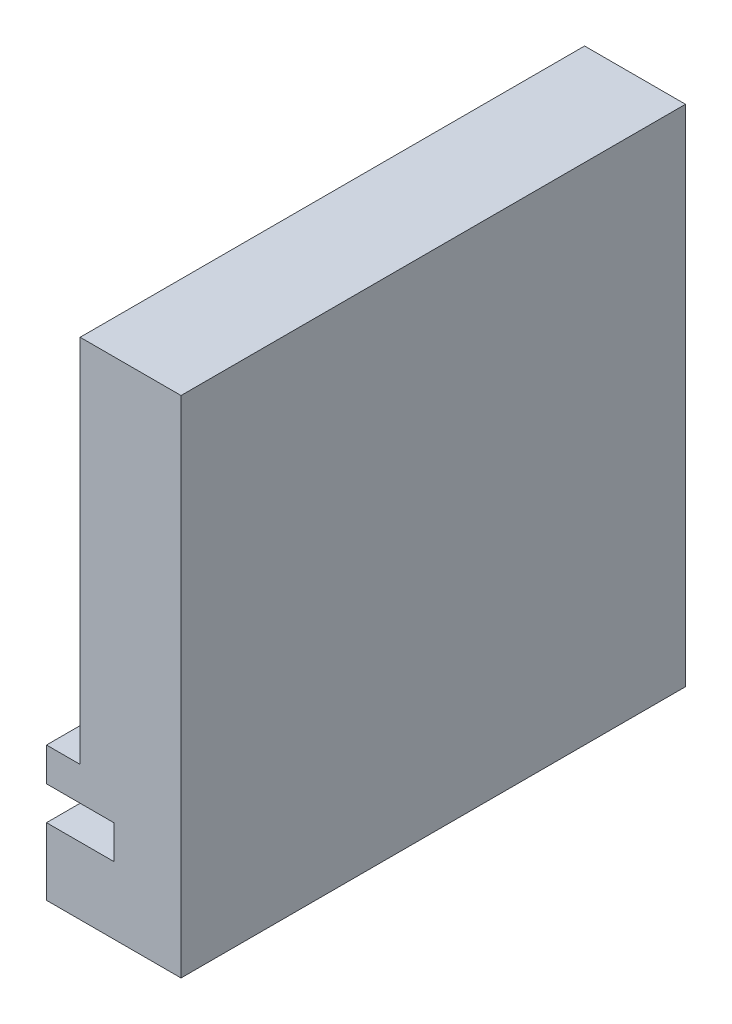
ISO-10303-21;
HEADER;
FILE_DESCRIPTION(('STEP AP214'),'2;1');
FILE_NAME('part.step','',(''),(''),'','','');
FILE_SCHEMA(('AUTOMOTIVE_DESIGN { 1 0 10303 214 1 1 1 1 }'));
ENDSEC;
DATA;
#1=APPLICATION_CONTEXT('core data for automotive mechanical design processes');
#2=APPLICATION_PROTOCOL_DEFINITION('international standard','automotive_design',2000,#1);
#3=PRODUCT_CONTEXT('',#1,'mechanical');
#4=PRODUCT('Part','Part','',(#3));
#5=PRODUCT_RELATED_PRODUCT_CATEGORY('part','',(#4));
#6=PRODUCT_DEFINITION_FORMATION('','',#4);
#7=PRODUCT_DEFINITION_CONTEXT('part definition',#1,'design');
#8=PRODUCT_DEFINITION('design','',#6,#7);
#9=PRODUCT_DEFINITION_SHAPE('','',#8);
#10=(LENGTH_UNIT() NAMED_UNIT(*) SI_UNIT(.MILLI.,.METRE.));
#11=(NAMED_UNIT(*) PLANE_ANGLE_UNIT() SI_UNIT($,.RADIAN.));
#12=(NAMED_UNIT(*) SI_UNIT($,.STERADIAN.) SOLID_ANGLE_UNIT());
#13=UNCERTAINTY_MEASURE_WITH_UNIT(LENGTH_MEASURE(1.E-05),#10,'distance_accuracy_value','');
#14=(GEOMETRIC_REPRESENTATION_CONTEXT(3) GLOBAL_UNCERTAINTY_ASSIGNED_CONTEXT((#13)) GLOBAL_UNIT_ASSIGNED_CONTEXT((#10,
#11,#12)) REPRESENTATION_CONTEXT('',''));
#15=CARTESIAN_POINT('',(0.,0.,0.));
#16=DIRECTION('',(0.,0.,1.));
#17=DIRECTION('',(1.,0.,0.));
#18=AXIS2_PLACEMENT_3D('',#15,#16,#17);
#19=CARTESIAN_POINT('',(20.,30.,150.));
#20=DIRECTION('',(1.,0.,0.));
#21=DIRECTION('',(0.,0.,-1.));
#22=AXIS2_PLACEMENT_3D('',#19,#20,#21);
#23=PLANE('',#22);
#24=DIRECTION('',(0.,-1.,0.));
#25=VECTOR('',#24,1.);
#26=CARTESIAN_POINT('',(20.,30.,0.));
#27=LINE('',#26,#25);
#28=CARTESIAN_POINT('',(20.,30.,0.));
#29=VERTEX_POINT('',#28);
#30=CARTESIAN_POINT('',(20.,20.,0.));
#31=VERTEX_POINT('',#30);
#32=EDGE_CURVE('E158',#29,#31,#27,.T.);
#33=ORIENTED_EDGE('',*,*,#32,.T.);
#34=DIRECTION('',(0.,0.,-1.));
#35=VECTOR('',#34,1.);
#36=CARTESIAN_POINT('',(20.,20.,150.));
#37=LINE('',#36,#35);
#38=CARTESIAN_POINT('',(20.,20.,150.));
#39=VERTEX_POINT('',#38);
#40=EDGE_CURVE('E11',#39,#31,#37,.T.);
#41=ORIENTED_EDGE('',*,*,#40,.F.);
#42=DIRECTION('',(0.,-1.,0.));
#43=VECTOR('',#42,1.);
#44=CARTESIAN_POINT('',(20.,30.,150.));
#45=LINE('',#44,#43);
#46=CARTESIAN_POINT('',(20.,30.,150.));
#47=VERTEX_POINT('',#46);
#48=EDGE_CURVE('E186',#47,#39,#45,.T.);
#49=ORIENTED_EDGE('',*,*,#48,.F.);
#50=DIRECTION('',(0.,0.,-1.));
#51=VECTOR('',#50,1.);
#52=CARTESIAN_POINT('',(20.,30.,150.));
#53=LINE('',#52,#51);
#54=EDGE_CURVE('E154',#47,#29,#53,.T.);
#55=ORIENTED_EDGE('',*,*,#54,.T.);
#56=EDGE_LOOP('',(#33,#41,#49,#55));
#57=FACE_BOUND('',#56,.T.);
#58=ADVANCED_FACE('F45',(#57),#23,.F.);
#59=CARTESIAN_POINT('',(20.,20.,150.));
#60=DIRECTION('',(0.,-1.,0.));
#61=DIRECTION('',(1.,0.,0.));
#62=AXIS2_PLACEMENT_3D('',#59,#60,#61);
#63=PLANE('',#62);
#64=DIRECTION('',(-1.,0.,0.));
#65=VECTOR('',#64,1.);
#66=CARTESIAN_POINT('',(20.,20.,0.));
#67=LINE('',#66,#65);
#68=CARTESIAN_POINT('',(0.,20.,0.));
#69=VERTEX_POINT('',#68);
#70=EDGE_CURVE('E162',#31,#69,#67,.T.);
#71=ORIENTED_EDGE('',*,*,#70,.T.);
#72=DIRECTION('',(0.,0.,-1.));
#73=VECTOR('',#72,1.);
#74=CARTESIAN_POINT('',(0.,20.,150.));
#75=LINE('',#74,#73);
#76=CARTESIAN_POINT('',(0.,20.,150.));
#77=VERTEX_POINT('',#76);
#78=EDGE_CURVE('E54',#77,#69,#75,.T.);
#79=ORIENTED_EDGE('',*,*,#78,.F.);
#80=DIRECTION('',(-1.,0.,0.));
#81=VECTOR('',#80,1.);
#82=CARTESIAN_POINT('',(20.,20.,150.));
#83=LINE('',#82,#81);
#84=EDGE_CURVE('E111',#39,#77,#83,.T.);
#85=ORIENTED_EDGE('',*,*,#84,.F.);
#86=ORIENTED_EDGE('',*,*,#40,.T.);
#87=EDGE_LOOP('',(#71,#79,#85,#86));
#88=FACE_BOUND('',#87,.T.);
#89=ADVANCED_FACE('F250',(#88),#63,.F.);
#90=CARTESIAN_POINT('',(0.,20.,150.));
#91=DIRECTION('',(1.,0.,0.));
#92=DIRECTION('',(0.,0.,-1.));
#93=AXIS2_PLACEMENT_3D('',#90,#91,#92);
#94=PLANE('',#93);
#95=DIRECTION('',(0.,-1.,0.));
#96=VECTOR('',#95,1.);
#97=CARTESIAN_POINT('',(0.,20.,0.));
#98=LINE('',#97,#96);
#99=CARTESIAN_POINT('',(0.,0.,0.));
#100=VERTEX_POINT('',#99);
#101=EDGE_CURVE('E165',#69,#100,#98,.T.);
#102=ORIENTED_EDGE('',*,*,#101,.T.);
#103=DIRECTION('',(0.,0.,-1.));
#104=VECTOR('',#103,1.);
#105=CARTESIAN_POINT('',(0.,0.,150.));
#106=LINE('',#105,#104);
#107=CARTESIAN_POINT('',(0.,0.,150.));
#108=VERTEX_POINT('',#107);
#109=EDGE_CURVE('E205',#108,#100,#106,.T.);
#110=ORIENTED_EDGE('',*,*,#109,.F.);
#111=DIRECTION('',(0.,-1.,0.));
#112=VECTOR('',#111,1.);
#113=CARTESIAN_POINT('',(0.,20.,150.));
#114=LINE('',#113,#112);
#115=EDGE_CURVE('E215',#77,#108,#114,.T.);
#116=ORIENTED_EDGE('',*,*,#115,.F.);
#117=ORIENTED_EDGE('',*,*,#78,.T.);
#118=EDGE_LOOP('',(#102,#110,#116,#117));
#119=FACE_BOUND('',#118,.T.);
#120=ADVANCED_FACE('F213',(#119),#94,.F.);
#121=CARTESIAN_POINT('',(0.,0.,150.));
#122=DIRECTION('',(0.,1.,0.));
#123=DIRECTION('',(0.,0.,1.));
#124=AXIS2_PLACEMENT_3D('',#121,#122,#123);
#125=PLANE('',#124);
#126=DIRECTION('',(1.,0.,0.));
#127=VECTOR('',#126,1.);
#128=CARTESIAN_POINT('',(0.,0.,0.));
#129=LINE('',#128,#127);
#130=CARTESIAN_POINT('',(40.,0.,0.));
#131=VERTEX_POINT('',#130);
#132=EDGE_CURVE('E168',#100,#131,#129,.T.);
#133=ORIENTED_EDGE('',*,*,#132,.T.);
#134=DIRECTION('',(0.,0.,-1.));
#135=VECTOR('',#134,1.);
#136=CARTESIAN_POINT('',(40.,0.,150.));
#137=LINE('',#136,#135);
#138=CARTESIAN_POINT('',(40.,0.,150.));
#139=VERTEX_POINT('',#138);
#140=EDGE_CURVE('E201',#139,#131,#137,.T.);
#141=ORIENTED_EDGE('',*,*,#140,.F.);
#142=DIRECTION('',(1.,0.,0.));
#143=VECTOR('',#142,1.);
#144=CARTESIAN_POINT('',(0.,0.,150.));
#145=LINE('',#144,#143);
#146=EDGE_CURVE('E234',#108,#139,#145,.T.);
#147=ORIENTED_EDGE('',*,*,#146,.F.);
#148=ORIENTED_EDGE('',*,*,#109,.T.);
#149=EDGE_LOOP('',(#133,#141,#147,#148));
#150=FACE_BOUND('',#149,.T.);
#151=ADVANCED_FACE('F224',(#150),#125,.F.);
#152=CARTESIAN_POINT('',(40.,0.,150.));
#153=DIRECTION('',(-1.,0.,0.));
#154=DIRECTION('',(0.,0.,1.));
#155=AXIS2_PLACEMENT_3D('',#152,#153,#154);
#156=PLANE('',#155);
#157=DIRECTION('',(0.,1.,0.));
#158=VECTOR('',#157,1.);
#159=CARTESIAN_POINT('',(40.,0.,0.));
#160=LINE('',#159,#158);
#161=CARTESIAN_POINT('',(40.,150.,0.));
#162=VERTEX_POINT('',#161);
#163=EDGE_CURVE('E171',#131,#162,#160,.T.);
#164=ORIENTED_EDGE('',*,*,#163,.T.);
#165=DIRECTION('',(0.,0.,-1.));
#166=VECTOR('',#165,1.);
#167=CARTESIAN_POINT('',(40.,150.,150.));
#168=LINE('',#167,#166);
#169=CARTESIAN_POINT('',(40.,150.,150.));
#170=VERTEX_POINT('',#169);
#171=EDGE_CURVE('E197',#170,#162,#168,.T.);
#172=ORIENTED_EDGE('',*,*,#171,.F.);
#173=DIRECTION('',(0.,1.,0.));
#174=VECTOR('',#173,1.);
#175=CARTESIAN_POINT('',(40.,0.,150.));
#176=LINE('',#175,#174);
#177=EDGE_CURVE('E230',#139,#170,#176,.T.);
#178=ORIENTED_EDGE('',*,*,#177,.F.);
#179=ORIENTED_EDGE('',*,*,#140,.T.);
#180=EDGE_LOOP('',(#164,#172,#178,#179));
#181=FACE_BOUND('',#180,.T.);
#182=ADVANCED_FACE('F228',(#181),#156,.F.);
#183=CARTESIAN_POINT('',(40.,150.,150.));
#184=DIRECTION('',(0.,-1.,0.));
#185=DIRECTION('',(0.,0.,-1.));
#186=AXIS2_PLACEMENT_3D('',#183,#184,#185);
#187=PLANE('',#186);
#188=DIRECTION('',(-1.,0.,0.));
#189=VECTOR('',#188,1.);
#190=CARTESIAN_POINT('',(40.,150.,0.));
#191=LINE('',#190,#189);
#192=CARTESIAN_POINT('',(10.,150.,0.));
#193=VERTEX_POINT('',#192);
#194=EDGE_CURVE('E174',#162,#193,#191,.T.);
#195=ORIENTED_EDGE('',*,*,#194,.T.);
#196=DIRECTION('',(0.,0.,-1.));
#197=VECTOR('',#196,1.);
#198=CARTESIAN_POINT('',(10.,150.,150.));
#199=LINE('',#198,#197);
#200=CARTESIAN_POINT('',(10.,150.,150.));
#201=VERTEX_POINT('',#200);
#202=EDGE_CURVE('E193',#201,#193,#199,.T.);
#203=ORIENTED_EDGE('',*,*,#202,.F.);
#204=DIRECTION('',(-1.,0.,0.));
#205=VECTOR('',#204,1.);
#206=CARTESIAN_POINT('',(40.,150.,150.));
#207=LINE('',#206,#205);
#208=EDGE_CURVE('E233',#170,#201,#207,.T.);
#209=ORIENTED_EDGE('',*,*,#208,.F.);
#210=ORIENTED_EDGE('',*,*,#171,.T.);
#211=EDGE_LOOP('',(#195,#203,#209,#210));
#212=FACE_BOUND('',#211,.T.);
#213=ADVANCED_FACE('F262',(#212),#187,.F.);
#214=CARTESIAN_POINT('',(10.,150.,150.));
#215=DIRECTION('',(1.,0.,0.));
#216=DIRECTION('',(0.,1.,0.));
#217=AXIS2_PLACEMENT_3D('',#214,#215,#216);
#218=PLANE('',#217);
#219=DIRECTION('',(0.,-1.,0.));
#220=VECTOR('',#219,1.);
#221=CARTESIAN_POINT('',(10.,150.,0.));
#222=LINE('',#221,#220);
#223=CARTESIAN_POINT('',(10.,40.,0.));
#224=VERTEX_POINT('',#223);
#225=EDGE_CURVE('E177',#193,#224,#222,.T.);
#226=ORIENTED_EDGE('',*,*,#225,.T.);
#227=DIRECTION('',(0.,0.,-1.));
#228=VECTOR('',#227,1.);
#229=CARTESIAN_POINT('',(10.,40.,150.));
#230=LINE('',#229,#228);
#231=CARTESIAN_POINT('',(10.,40.,150.));
#232=VERTEX_POINT('',#231);
#233=EDGE_CURVE('E147',#232,#224,#230,.T.);
#234=ORIENTED_EDGE('',*,*,#233,.F.);
#235=DIRECTION('',(0.,-1.,0.));
#236=VECTOR('',#235,1.);
#237=CARTESIAN_POINT('',(10.,150.,150.));
#238=LINE('',#237,#236);
#239=EDGE_CURVE('E136',#201,#232,#238,.T.);
#240=ORIENTED_EDGE('',*,*,#239,.F.);
#241=ORIENTED_EDGE('',*,*,#202,.T.);
#242=EDGE_LOOP('',(#226,#234,#240,#241));
#243=FACE_BOUND('',#242,.T.);
#244=ADVANCED_FACE('F265',(#243),#218,.F.);
#245=CARTESIAN_POINT('',(0.,40.,150.));
#246=DIRECTION('',(0.,-1.,0.));
#247=DIRECTION('',(0.,0.,-1.));
#248=AXIS2_PLACEMENT_3D('',#245,#246,#247);
#249=PLANE('',#248);
#250=DIRECTION('',(-1.,0.,0.));
#251=VECTOR('',#250,1.);
#252=CARTESIAN_POINT('',(0.,40.,0.));
#253=LINE('',#252,#251);
#254=CARTESIAN_POINT('',(0.,40.,0.));
#255=VERTEX_POINT('',#254);
#256=EDGE_CURVE('E145',#224,#255,#253,.T.);
#257=ORIENTED_EDGE('',*,*,#256,.T.);
#258=DIRECTION('',(0.,0.,-1.));
#259=VECTOR('',#258,1.);
#260=CARTESIAN_POINT('',(0.,40.,150.));
#261=LINE('',#260,#259);
#262=CARTESIAN_POINT('',(0.,40.,150.));
#263=VERTEX_POINT('',#262);
#264=EDGE_CURVE('E142',#263,#255,#261,.T.);
#265=ORIENTED_EDGE('',*,*,#264,.F.);
#266=DIRECTION('',(-1.,0.,0.));
#267=VECTOR('',#266,1.);
#268=CARTESIAN_POINT('',(0.,40.,150.));
#269=LINE('',#268,#267);
#270=EDGE_CURVE('E130',#232,#263,#269,.T.);
#271=ORIENTED_EDGE('',*,*,#270,.F.);
#272=ORIENTED_EDGE('',*,*,#233,.T.);
#273=EDGE_LOOP('',(#257,#265,#271,#272));
#274=FACE_BOUND('',#273,.T.);
#275=ADVANCED_FACE('F143',(#274),#249,.F.);
#276=CARTESIAN_POINT('',(0.,40.,150.));
#277=DIRECTION('',(1.,0.,0.));
#278=DIRECTION('',(0.,1.,0.));
#279=AXIS2_PLACEMENT_3D('',#276,#277,#278);
#280=PLANE('',#279);
#281=DIRECTION('',(0.,-1.,0.));
#282=VECTOR('',#281,1.);
#283=CARTESIAN_POINT('',(0.,40.,0.));
#284=LINE('',#283,#282);
#285=CARTESIAN_POINT('',(0.,30.,0.));
#286=VERTEX_POINT('',#285);
#287=EDGE_CURVE('E97',#255,#286,#284,.T.);
#288=ORIENTED_EDGE('',*,*,#287,.T.);
#289=DIRECTION('',(0.,0.,-1.));
#290=VECTOR('',#289,1.);
#291=CARTESIAN_POINT('',(0.,30.,150.));
#292=LINE('',#291,#290);
#293=CARTESIAN_POINT('',(0.,30.,150.));
#294=VERTEX_POINT('',#293);
#295=EDGE_CURVE('E148',#294,#286,#292,.T.);
#296=ORIENTED_EDGE('',*,*,#295,.F.);
#297=DIRECTION('',(0.,-1.,0.));
#298=VECTOR('',#297,1.);
#299=CARTESIAN_POINT('',(0.,40.,150.));
#300=LINE('',#299,#298);
#301=EDGE_CURVE('E134',#263,#294,#300,.T.);
#302=ORIENTED_EDGE('',*,*,#301,.F.);
#303=ORIENTED_EDGE('',*,*,#264,.T.);
#304=EDGE_LOOP('',(#288,#296,#302,#303));
#305=FACE_BOUND('',#304,.T.);
#306=ADVANCED_FACE('F150',(#305),#280,.F.);
#307=CARTESIAN_POINT('',(0.,30.,150.));
#308=DIRECTION('',(0.,1.,0.));
#309=DIRECTION('',(0.,0.,1.));
#310=AXIS2_PLACEMENT_3D('',#307,#308,#309);
#311=PLANE('',#310);
#312=DIRECTION('',(1.,0.,0.));
#313=VECTOR('',#312,1.);
#314=CARTESIAN_POINT('',(0.,30.,0.));
#315=LINE('',#314,#313);
#316=EDGE_CURVE('E103',#286,#29,#315,.T.);
#317=ORIENTED_EDGE('',*,*,#316,.T.);
#318=ORIENTED_EDGE('',*,*,#54,.F.);
#319=DIRECTION('',(1.,0.,0.));
#320=VECTOR('',#319,1.);
#321=CARTESIAN_POINT('',(0.,30.,150.));
#322=LINE('',#321,#320);
#323=EDGE_CURVE('E62',#294,#47,#322,.T.);
#324=ORIENTED_EDGE('',*,*,#323,.F.);
#325=ORIENTED_EDGE('',*,*,#295,.T.);
#326=EDGE_LOOP('',(#317,#318,#324,#325));
#327=FACE_BOUND('',#326,.T.);
#328=ADVANCED_FACE('F274',(#327),#311,.F.);
#329=CARTESIAN_POINT('',(0.,0.,150.));
#330=DIRECTION('',(0.,0.,-1.));
#331=DIRECTION('',(-1.,0.,0.));
#332=AXIS2_PLACEMENT_3D('',#329,#330,#331);
#333=PLANE('',#332);
#334=ORIENTED_EDGE('',*,*,#48,.T.);
#335=ORIENTED_EDGE('',*,*,#84,.T.);
#336=ORIENTED_EDGE('',*,*,#115,.T.);
#337=ORIENTED_EDGE('',*,*,#146,.T.);
#338=ORIENTED_EDGE('',*,*,#177,.T.);
#339=ORIENTED_EDGE('',*,*,#208,.T.);
#340=ORIENTED_EDGE('',*,*,#239,.T.);
#341=ORIENTED_EDGE('',*,*,#270,.T.);
#342=ORIENTED_EDGE('',*,*,#301,.T.);
#343=ORIENTED_EDGE('',*,*,#323,.T.);
#344=EDGE_LOOP('',(#334,#335,#336,#337,#338,#339,#340,#341,#342,#343));
#345=FACE_BOUND('',#344,.T.);
#346=ADVANCED_FACE('F132',(#345),#333,.F.);
#347=CARTESIAN_POINT('',(0.,0.,0.));
#348=DIRECTION('',(0.,0.,-1.));
#349=DIRECTION('',(-1.,0.,0.));
#350=AXIS2_PLACEMENT_3D('',#347,#348,#349);
#351=PLANE('',#350);
#352=ORIENTED_EDGE('',*,*,#32,.F.);
#353=ORIENTED_EDGE('',*,*,#316,.F.);
#354=ORIENTED_EDGE('',*,*,#287,.F.);
#355=ORIENTED_EDGE('',*,*,#256,.F.);
#356=ORIENTED_EDGE('',*,*,#225,.F.);
#357=ORIENTED_EDGE('',*,*,#194,.F.);
#358=ORIENTED_EDGE('',*,*,#163,.F.);
#359=ORIENTED_EDGE('',*,*,#132,.F.);
#360=ORIENTED_EDGE('',*,*,#101,.F.);
#361=ORIENTED_EDGE('',*,*,#70,.F.);
#362=EDGE_LOOP('',(#352,#353,#354,#355,#356,#357,#358,#359,#360,#361));
#363=FACE_BOUND('',#362,.T.);
#364=ADVANCED_FACE('F219',(#363),#351,.T.);
#365=CLOSED_SHELL('',(#58,#89,#120,#151,#182,#213,#244,#275,#306,#328,#346,#364));
#366=MANIFOLD_SOLID_BREP('B2',#365);
#367=ADVANCED_BREP_SHAPE_REPRESENTATION('',(#18,#366),#14);
#368=SHAPE_DEFINITION_REPRESENTATION(#9,#367);
ENDSEC;
END-ISO-10303-21;
